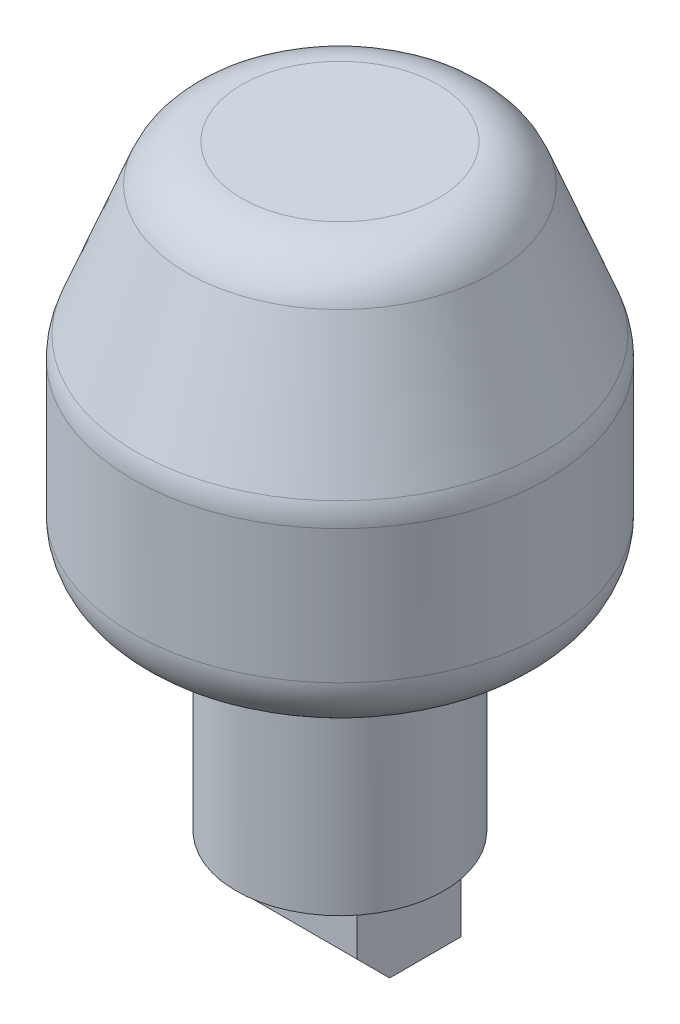
ISO-10303-21;
HEADER;
FILE_DESCRIPTION(('STEP AP214'),'2;1');
FILE_NAME('part.step','',(''),(''),'','','');
FILE_SCHEMA(('AUTOMOTIVE_DESIGN { 1 0 10303 214 1 1 1 1 }'));
ENDSEC;
DATA;
#1=APPLICATION_CONTEXT('core data for automotive mechanical design processes');
#2=APPLICATION_PROTOCOL_DEFINITION('international standard','automotive_design',2000,#1);
#3=PRODUCT_CONTEXT('',#1,'mechanical');
#4=PRODUCT('Part','Part','',(#3));
#5=PRODUCT_RELATED_PRODUCT_CATEGORY('part','',(#4));
#6=PRODUCT_DEFINITION_FORMATION('','',#4);
#7=PRODUCT_DEFINITION_CONTEXT('part definition',#1,'design');
#8=PRODUCT_DEFINITION('design','',#6,#7);
#9=PRODUCT_DEFINITION_SHAPE('','',#8);
#10=(LENGTH_UNIT() NAMED_UNIT(*) SI_UNIT(.MILLI.,.METRE.));
#11=(NAMED_UNIT(*) PLANE_ANGLE_UNIT() SI_UNIT($,.RADIAN.));
#12=(NAMED_UNIT(*) SI_UNIT($,.STERADIAN.) SOLID_ANGLE_UNIT());
#13=UNCERTAINTY_MEASURE_WITH_UNIT(LENGTH_MEASURE(1.E-05),#10,'distance_accuracy_value','');
#14=(GEOMETRIC_REPRESENTATION_CONTEXT(3) GLOBAL_UNCERTAINTY_ASSIGNED_CONTEXT((#13)) GLOBAL_UNIT_ASSIGNED_CONTEXT((#10,
#11,#12)) REPRESENTATION_CONTEXT('',''));
#15=CARTESIAN_POINT('',(0.,0.,0.));
#16=DIRECTION('',(0.,0.,1.));
#17=DIRECTION('',(1.,0.,0.));
#18=AXIS2_PLACEMENT_3D('',#15,#16,#17);
#19=CARTESIAN_POINT('',(7.4549,-9.01718142394338,0.));
#20=DIRECTION('',(0.,-1.,0.));
#21=DIRECTION('',(0.,0.,-1.));
#22=AXIS2_PLACEMENT_3D('',#19,#20,#21);
#23=PLANE('',#22);
#24=DIRECTION('',(0.,0.,1.));
#25=VECTOR('',#24,1.);
#26=CARTESIAN_POINT('',(7.3279,-9.01718142394338,0.));
#27=LINE('',#26,#25);
#28=CARTESIAN_POINT('',(7.3279,-9.01718142394338,-5.49919071197169));
#29=VERTEX_POINT('',#28);
#30=CARTESIAN_POINT('',(7.3279,-9.01718142394338,1.9430092880283));
#31=VERTEX_POINT('',#30);
#32=EDGE_CURVE('E59',#29,#31,#27,.T.);
#33=ORIENTED_EDGE('',*,*,#32,.F.);
#34=DIRECTION('',(1.,0.,0.));
#35=VECTOR('',#34,1.);
#36=CARTESIAN_POINT('',(0.,-9.01718142394338,-5.49919071197169));
#37=LINE('',#36,#35);
#38=CARTESIAN_POINT('',(2.54762,-9.01718142394338,-5.49919071197169));
#39=VERTEX_POINT('',#38);
#40=EDGE_CURVE('E210',#39,#29,#37,.T.);
#41=ORIENTED_EDGE('',*,*,#40,.F.);
#42=DIRECTION('',(0.,0.,-1.));
#43=VECTOR('',#42,1.);
#44=CARTESIAN_POINT('',(2.54762,-9.01718142394338,0.));
#45=LINE('',#44,#43);
#46=CARTESIAN_POINT('',(2.54762,-9.01718142394338,1.94300928802831));
#47=VERTEX_POINT('',#46);
#48=EDGE_CURVE('E225',#47,#39,#45,.T.);
#49=ORIENTED_EDGE('',*,*,#48,.F.);
#50=DIRECTION('',(-1.,0.,0.));
#51=VECTOR('',#50,1.);
#52=CARTESIAN_POINT('',(0.,-9.01718142394338,1.9430092880283));
#53=LINE('',#52,#51);
#54=EDGE_CURVE('E221',#31,#47,#53,.T.);
#55=ORIENTED_EDGE('',*,*,#54,.F.);
#56=EDGE_LOOP('',(#33,#41,#49,#55));
#57=FACE_BOUND('',#56,.T.);
#58=DIRECTION('',(-1.,0.,0.));
#59=VECTOR('',#58,1.);
#60=CARTESIAN_POINT('',(0.,-9.01718142394338,1.9430092880283));
#61=LINE('',#60,#59);
#62=CARTESIAN_POINT('',(-2.54762,-9.01718142394338,1.9430092880283));
#63=VERTEX_POINT('',#62);
#64=CARTESIAN_POINT('',(-7.3279,-9.01718142394338,1.9430092880283));
#65=VERTEX_POINT('',#64);
#66=EDGE_CURVE('E285',#63,#65,#61,.T.);
#67=ORIENTED_EDGE('',*,*,#66,.F.);
#68=DIRECTION('',(0.,0.,-1.));
#69=VECTOR('',#68,1.);
#70=CARTESIAN_POINT('',(-2.54762,-9.01718142394338,0.));
#71=LINE('',#70,#69);
#72=CARTESIAN_POINT('',(-2.54762,-9.01718142394338,-5.49919071197169));
#73=VERTEX_POINT('',#72);
#74=EDGE_CURVE('E263',#63,#73,#71,.T.);
#75=ORIENTED_EDGE('',*,*,#74,.T.);
#76=DIRECTION('',(1.,0.,0.));
#77=VECTOR('',#76,1.);
#78=CARTESIAN_POINT('',(0.,-9.01718142394338,-5.49919071197169));
#79=LINE('',#78,#77);
#80=CARTESIAN_POINT('',(-7.3279,-9.01718142394338,-5.49919071197169));
#81=VERTEX_POINT('',#80);
#82=EDGE_CURVE('E273',#81,#73,#79,.T.);
#83=ORIENTED_EDGE('',*,*,#82,.F.);
#84=DIRECTION('',(0.,0.,-1.));
#85=VECTOR('',#84,1.);
#86=CARTESIAN_POINT('',(-7.3279,-9.01718142394338,0.));
#87=LINE('',#86,#85);
#88=EDGE_CURVE('E288',#65,#81,#87,.T.);
#89=ORIENTED_EDGE('',*,*,#88,.F.);
#90=EDGE_LOOP('',(#67,#75,#83,#89));
#91=FACE_BOUND('',#90,.T.);
#92=DIRECTION('',(0.,0.,1.));
#93=VECTOR('',#92,1.);
#94=CARTESIAN_POINT('',(-7.4549,-9.01718142394338,0.));
#95=LINE('',#94,#93);
#96=CARTESIAN_POINT('',(-7.4549,-9.01718142394338,-5.6261907119717));
#97=VERTEX_POINT('',#96);
#98=CARTESIAN_POINT('',(-7.4549,-9.01718142394338,2.0700092880283));
#99=VERTEX_POINT('',#98);
#100=EDGE_CURVE('E323',#97,#99,#95,.T.);
#101=ORIENTED_EDGE('',*,*,#100,.F.);
#102=DIRECTION('',(-1.,0.,0.));
#103=VECTOR('',#102,1.);
#104=CARTESIAN_POINT('',(7.4549,-9.01718142394338,-5.6261907119717));
#105=LINE('',#104,#103);
#106=CARTESIAN_POINT('',(7.4549,-9.01718142394338,-5.6261907119717));
#107=VERTEX_POINT('',#106);
#108=EDGE_CURVE('E329',#107,#97,#105,.T.);
#109=ORIENTED_EDGE('',*,*,#108,.F.);
#110=DIRECTION('',(0.,0.,1.));
#111=VECTOR('',#110,1.);
#112=CARTESIAN_POINT('',(7.4549,-9.01718142394338,0.));
#113=LINE('',#112,#111);
#114=CARTESIAN_POINT('',(7.4549,-9.01718142394338,2.0700092880283));
#115=VERTEX_POINT('',#114);
#116=EDGE_CURVE('E309',#107,#115,#113,.T.);
#117=ORIENTED_EDGE('',*,*,#116,.T.);
#118=DIRECTION('',(-1.,0.,0.));
#119=VECTOR('',#118,1.);
#120=CARTESIAN_POINT('',(7.4549,-9.01718142394338,2.0700092880283));
#121=LINE('',#120,#119);
#122=EDGE_CURVE('E331',#115,#99,#121,.T.);
#123=ORIENTED_EDGE('',*,*,#122,.T.);
#124=EDGE_LOOP('',(#101,#109,#117,#123));
#125=FACE_BOUND('',#124,.T.);
#126=DIRECTION('',(-1.,0.,0.));
#127=VECTOR('',#126,1.);
#128=CARTESIAN_POINT('',(0.,-9.01718142394338,1.9430092880283));
#129=LINE('',#128,#127);
#130=CARTESIAN_POINT('',(2.42062,-9.01718142394338,1.9430092880283));
#131=VERTEX_POINT('',#130);
#132=CARTESIAN_POINT('',(-2.42062,-9.01718142394338,1.94300928802831));
#133=VERTEX_POINT('',#132);
#134=EDGE_CURVE('E253',#131,#133,#129,.T.);
#135=ORIENTED_EDGE('',*,*,#134,.F.);
#136=DIRECTION('',(0.,0.,-1.));
#137=VECTOR('',#136,1.);
#138=CARTESIAN_POINT('',(2.42062,-9.01718142394338,0.));
#139=LINE('',#138,#137);
#140=CARTESIAN_POINT('',(2.42062,-9.01718142394338,-5.49919071197169));
#141=VERTEX_POINT('',#140);
#142=EDGE_CURVE('E232',#131,#141,#139,.T.);
#143=ORIENTED_EDGE('',*,*,#142,.T.);
#144=DIRECTION('',(1.,0.,0.));
#145=VECTOR('',#144,1.);
#146=CARTESIAN_POINT('',(0.,-9.01718142394338,-5.49919071197169));
#147=LINE('',#146,#145);
#148=CARTESIAN_POINT('',(-2.42062,-9.01718142394338,-5.49919071197169));
#149=VERTEX_POINT('',#148);
#150=EDGE_CURVE('E241',#149,#141,#147,.T.);
#151=ORIENTED_EDGE('',*,*,#150,.F.);
#152=DIRECTION('',(0.,0.,-1.));
#153=VECTOR('',#152,1.);
#154=CARTESIAN_POINT('',(-2.42062,-9.01718142394338,0.));
#155=LINE('',#154,#153);
#156=EDGE_CURVE('E256',#133,#149,#155,.T.);
#157=ORIENTED_EDGE('',*,*,#156,.F.);
#158=EDGE_LOOP('',(#135,#143,#151,#157));
#159=FACE_BOUND('',#158,.T.);
#160=ADVANCED_FACE('F36',(#57,#91,#125,#159),#23,.T.);
#161=CARTESIAN_POINT('',(0.,0.,0.));
#162=DIRECTION('',(0.,1.,0.));
#163=DIRECTION('',(-1.,0.,0.));
#164=AXIS2_PLACEMENT_3D('',#161,#162,#163);
#165=PLANE('',#164);
#166=DIRECTION('',(-1.,0.,0.));
#167=VECTOR('',#166,1.);
#168=CARTESIAN_POINT('',(7.4549,0.,5.62619071197169));
#169=LINE('',#168,#167);
#170=CARTESIAN_POINT('',(7.4549,0.,5.62619071197169));
#171=VERTEX_POINT('',#170);
#172=CARTESIAN_POINT('',(-7.4549,0.,5.62619071197169));
#173=VERTEX_POINT('',#172);
#174=EDGE_CURVE('E336',#171,#173,#169,.T.);
#175=ORIENTED_EDGE('',*,*,#174,.F.);
#176=DIRECTION('',(0.,0.,-1.));
#177=VECTOR('',#176,1.);
#178=CARTESIAN_POINT('',(7.4549,0.,0.));
#179=LINE('',#178,#177);
#180=CARTESIAN_POINT('',(7.4549,0.,-5.62619071197169));
#181=VERTEX_POINT('',#180);
#182=EDGE_CURVE('E302',#171,#181,#179,.T.);
#183=ORIENTED_EDGE('',*,*,#182,.T.);
#184=DIRECTION('',(-1.,0.,0.));
#185=VECTOR('',#184,1.);
#186=CARTESIAN_POINT('',(7.4549,0.,-5.62619071197169));
#187=LINE('',#186,#185);
#188=CARTESIAN_POINT('',(-7.4549,0.,-5.62619071197169));
#189=VERTEX_POINT('',#188);
#190=EDGE_CURVE('E315',#181,#189,#187,.T.);
#191=ORIENTED_EDGE('',*,*,#190,.T.);
#192=DIRECTION('',(0.,0.,-1.));
#193=VECTOR('',#192,1.);
#194=CARTESIAN_POINT('',(-7.4549,0.,0.));
#195=LINE('',#194,#193);
#196=EDGE_CURVE('E295',#173,#189,#195,.T.);
#197=ORIENTED_EDGE('',*,*,#196,.F.);
#198=EDGE_LOOP('',(#175,#183,#191,#197));
#199=FACE_BOUND('',#198,.T.);
#200=CARTESIAN_POINT('',(0.,0.,0.));
#201=DIRECTION('',(0.,1.,0.));
#202=DIRECTION('',(-1.,0.,0.));
#203=AXIS2_PLACEMENT_3D('',#200,#201,#202);
#204=CIRCLE('',#203,11.2395);
#205=CARTESIAN_POINT('',(-11.2395,0.,0.));
#206=VERTEX_POINT('',#205);
#207=EDGE_CURVE('E341',#206,#206,#204,.T.);
#208=ORIENTED_EDGE('',*,*,#207,.F.);
#209=EDGE_LOOP('',(#208));
#210=FACE_BOUND('',#209,.T.);
#211=ADVANCED_FACE('F377',(#199,#210),#165,.F.);
#212=CARTESIAN_POINT('',(0.,64.6193127521161,0.));
#213=DIRECTION('',(0.,1.,0.));
#214=DIRECTION('',(-1.,0.,0.));
#215=AXIS2_PLACEMENT_3D('',#212,#213,#214);
#216=CYLINDRICAL_SURFACE('',#215,11.2395);
#217=CARTESIAN_POINT('',(0.,21.2344,0.));
#218=DIRECTION('',(0.,-1.,0.));
#219=DIRECTION('',(0.,0.,-1.));
#220=AXIS2_PLACEMENT_3D('',#217,#218,#219);
#221=CIRCLE('',#220,11.2395);
#222=CARTESIAN_POINT('',(-1.778,21.2344,11.0979762231679));
#223=VERTEX_POINT('',#222);
#224=CARTESIAN_POINT('',(1.778,21.2344,11.0979762231679));
#225=VERTEX_POINT('',#224);
#226=EDGE_CURVE('E183',#223,#225,#221,.F.);
#227=ORIENTED_EDGE('',*,*,#226,.F.);
#228=DIRECTION('',(0.,1.,0.));
#229=VECTOR('',#228,1.);
#230=CARTESIAN_POINT('',(-1.778,64.6193127521161,11.0979762231679));
#231=LINE('',#230,#229);
#232=CARTESIAN_POINT('',(-1.778,23.4188,11.0979762231679));
#233=VERTEX_POINT('',#232);
#234=EDGE_CURVE('E188',#233,#223,#231,.F.);
#235=ORIENTED_EDGE('',*,*,#234,.F.);
#236=CARTESIAN_POINT('',(0.,23.4188,0.));
#237=DIRECTION('',(0.,1.,0.));
#238=DIRECTION('',(-1.,0.,0.));
#239=AXIS2_PLACEMENT_3D('',#236,#237,#238);
#240=CIRCLE('',#239,11.2395);
#241=CARTESIAN_POINT('',(1.778,23.4188,11.0979762231679));
#242=VERTEX_POINT('',#241);
#243=EDGE_CURVE('E339',#242,#233,#240,.T.);
#244=ORIENTED_EDGE('',*,*,#243,.F.);
#245=DIRECTION('',(0.,1.,0.));
#246=VECTOR('',#245,1.);
#247=CARTESIAN_POINT('',(1.778,64.6193127521161,11.0979762231679));
#248=LINE('',#247,#246);
#249=EDGE_CURVE('E51',#225,#242,#248,.T.);
#250=ORIENTED_EDGE('',*,*,#249,.F.);
#251=EDGE_LOOP('',(#227,#235,#244,#250));
#252=FACE_BOUND('',#251,.T.);
#253=ORIENTED_EDGE('',*,*,#207,.T.);
#254=EDGE_LOOP('',(#253));
#255=FACE_BOUND('',#254,.T.);
#256=ADVANCED_FACE('F198',(#252,#255),#216,.T.);
#257=CARTESIAN_POINT('',(11.2395,23.4188,0.));
#258=DIRECTION('',(0.,1.,0.));
#259=DIRECTION('',(-1.,0.,0.));
#260=AXIS2_PLACEMENT_3D('',#257,#258,#259);
#261=PLANE('',#260);
#262=CARTESIAN_POINT('',(0.,23.4188,0.));
#263=DIRECTION('',(0.,1.,0.));
#264=DIRECTION('',(-1.,0.,0.));
#265=AXIS2_PLACEMENT_3D('',#262,#263,#264);
#266=CIRCLE('',#265,16.123370687632);
#267=CARTESIAN_POINT('',(-16.123370687632,23.4188,0.));
#268=VERTEX_POINT('',#267);
#269=EDGE_CURVE('E350',#268,#268,#266,.F.);
#270=ORIENTED_EDGE('',*,*,#269,.T.);
#271=EDGE_LOOP('',(#270));
#272=FACE_BOUND('',#271,.T.);
#273=ORIENTED_EDGE('',*,*,#243,.T.);
#274=DIRECTION('',(0.,0.,1.));
#275=VECTOR('',#274,1.);
#276=CARTESIAN_POINT('',(-1.778,23.4188,-22.474370687632));
#277=LINE('',#276,#275);
#278=CARTESIAN_POINT('',(-1.778,23.4188,14.29512));
#279=VERTEX_POINT('',#278);
#280=EDGE_CURVE('E193',#233,#279,#277,.T.);
#281=ORIENTED_EDGE('',*,*,#280,.T.);
#282=DIRECTION('',(-1.,0.,0.));
#283=VECTOR('',#282,1.);
#284=CARTESIAN_POINT('',(-1.778,23.4188,14.29512));
#285=LINE('',#284,#283);
#286=CARTESIAN_POINT('',(1.778,23.4188,14.29512));
#287=VERTEX_POINT('',#286);
#288=EDGE_CURVE('E771',#287,#279,#285,.T.);
#289=ORIENTED_EDGE('',*,*,#288,.F.);
#290=DIRECTION('',(0.,0.,1.));
#291=VECTOR('',#290,1.);
#292=CARTESIAN_POINT('',(1.778,23.4188,-22.474370687632));
#293=LINE('',#292,#291);
#294=EDGE_CURVE('E222',#242,#287,#293,.T.);
#295=ORIENTED_EDGE('',*,*,#294,.F.);
#296=EDGE_LOOP('',(#273,#281,#289,#295));
#297=FACE_BOUND('',#296,.T.);
#298=ADVANCED_FACE('F405',(#272,#297),#261,.F.);
#299=CARTESIAN_POINT('',(0.,64.6193127521161,0.));
#300=DIRECTION('',(0.,1.,0.));
#301=DIRECTION('',(-1.,0.,0.));
#302=AXIS2_PLACEMENT_3D('',#299,#300,#301);
#303=CYLINDRICAL_SURFACE('',#302,22.473370687632);
#304=CARTESIAN_POINT('',(0.,29.7688,0.));
#305=DIRECTION('',(0.,1.,0.));
#306=DIRECTION('',(-1.,0.,0.));
#307=AXIS2_PLACEMENT_3D('',#304,#305,#306);
#308=CIRCLE('',#307,22.473370687632);
#309=CARTESIAN_POINT('',(-22.473370687632,29.7688,0.));
#310=VERTEX_POINT('',#309);
#311=EDGE_CURVE('E347',#310,#310,#308,.T.);
#312=ORIENTED_EDGE('',*,*,#311,.T.);
#313=EDGE_LOOP('',(#312));
#314=FACE_BOUND('',#313,.T.);
#315=CARTESIAN_POINT('',(0.,44.2210933640308,0.));
#316=DIRECTION('',(0.,-1.,0.));
#317=DIRECTION('',(1.,0.,0.));
#318=AXIS2_PLACEMENT_3D('',#315,#316,#317);
#319=CIRCLE('',#318,22.473370687632);
#320=CARTESIAN_POINT('',(22.473370687632,44.2210933640308,0.));
#321=VERTEX_POINT('',#320);
#322=EDGE_CURVE('E344',#321,#321,#319,.T.);
#323=ORIENTED_EDGE('',*,*,#322,.T.);
#324=EDGE_LOOP('',(#323));
#325=FACE_BOUND('',#324,.T.);
#326=ADVANCED_FACE('F402',(#314,#325),#303,.T.);
#327=CARTESIAN_POINT('',(0.,45.4152,0.));
#328=DIRECTION('',(0.,-1.,0.));
#329=DIRECTION('',(1.,0.,0.));
#330=AXIS2_PLACEMENT_3D('',#327,#328,#329);
#331=CONICAL_SURFACE('',#330,22.473370687632,0.371755130674789);
#332=CARTESIAN_POINT('',(0.,46.5277386775342,0.));
#333=DIRECTION('',(0.,1.,0.));
#334=DIRECTION('',(-1.,0.,0.));
#335=AXIS2_PLACEMENT_3D('',#332,#333,#334);
#336=CIRCLE('',#335,22.0396099828003);
#337=CARTESIAN_POINT('',(-22.0396099828003,46.5277386775342,0.));
#338=VERTEX_POINT('',#337);
#339=EDGE_CURVE('E44',#338,#338,#336,.T.);
#340=ORIENTED_EDGE('',*,*,#339,.T.);
#341=EDGE_LOOP('',(#340));
#342=FACE_BOUND('',#341,.T.);
#343=CARTESIAN_POINT('',(0.,60.5759580656195,0.));
#344=DIRECTION('',(0.,1.,0.));
#345=DIRECTION('',(-1.,0.,0.));
#346=AXIS2_PLACEMENT_3D('',#343,#344,#345);
#347=CIRCLE('',#346,16.5624381177172);
#348=CARTESIAN_POINT('',(-16.5624381177172,60.5759580656195,0.));
#349=VERTEX_POINT('',#348);
#350=EDGE_CURVE('E353',#349,#349,#347,.F.);
#351=ORIENTED_EDGE('',*,*,#350,.T.);
#352=EDGE_LOOP('',(#351));
#353=FACE_BOUND('',#352,.T.);
#354=ADVANCED_FACE('F358',(#342,#353),#331,.T.);
#355=CARTESIAN_POINT('',(14.986,64.6193127521161,0.));
#356=DIRECTION('',(0.,-1.,0.));
#357=DIRECTION('',(1.,0.,0.));
#358=AXIS2_PLACEMENT_3D('',#355,#356,#357);
#359=PLANE('',#358);
#360=CARTESIAN_POINT('',(0.,64.6193127521161,0.));
#361=DIRECTION('',(0.,-1.,0.));
#362=DIRECTION('',(1.,0.,0.));
#363=AXIS2_PLACEMENT_3D('',#360,#361,#362);
#364=CIRCLE('',#363,10.6461988225489);
#365=CARTESIAN_POINT('',(10.6461988225489,64.6193127521161,0.));
#366=VERTEX_POINT('',#365);
#367=EDGE_CURVE('E11',#366,#366,#364,.F.);
#368=ORIENTED_EDGE('',*,*,#367,.T.);
#369=EDGE_LOOP('',(#368));
#370=FACE_BOUND('',#369,.T.);
#371=ADVANCED_FACE('F372',(#370),#359,.F.);
#372=CARTESIAN_POINT('',(0.,29.7688,0.));
#373=DIRECTION('',(0.,1.,0.));
#374=DIRECTION('',(-1.,0.,0.));
#375=AXIS2_PLACEMENT_3D('',#372,#373,#374);
#376=TOROIDAL_SURFACE('',#375,16.123370687632,6.35);
#377=ORIENTED_EDGE('',*,*,#269,.F.);
#378=EDGE_LOOP('',(#377));
#379=FACE_BOUND('',#378,.T.);
#380=ORIENTED_EDGE('',*,*,#311,.F.);
#381=EDGE_LOOP('',(#380));
#382=FACE_BOUND('',#381,.T.);
#383=ADVANCED_FACE('F363',(#379,#382),#376,.T.);
#384=CARTESIAN_POINT('',(0.,44.2210933640308,0.));
#385=DIRECTION('',(0.,-1.,0.));
#386=DIRECTION('',(1.,0.,0.));
#387=AXIS2_PLACEMENT_3D('',#384,#385,#386);
#388=TOROIDAL_SURFACE('',#387,16.123370687632,6.35);
#389=ORIENTED_EDGE('',*,*,#322,.F.);
#390=EDGE_LOOP('',(#389));
#391=FACE_BOUND('',#390,.T.);
#392=ORIENTED_EDGE('',*,*,#339,.F.);
#393=EDGE_LOOP('',(#392));
#394=FACE_BOUND('',#393,.T.);
#395=ADVANCED_FACE('F361',(#391,#394),#388,.T.);
#396=CARTESIAN_POINT('',(0.,58.2693127521161,0.));
#397=DIRECTION('',(0.,-1.,0.));
#398=DIRECTION('',(1.,0.,0.));
#399=AXIS2_PLACEMENT_3D('',#396,#397,#398);
#400=TOROIDAL_SURFACE('',#399,10.6461988225489,6.35);
#401=ORIENTED_EDGE('',*,*,#350,.F.);
#402=EDGE_LOOP('',(#401));
#403=FACE_BOUND('',#402,.T.);
#404=ORIENTED_EDGE('',*,*,#367,.F.);
#405=EDGE_LOOP('',(#404));
#406=FACE_BOUND('',#405,.T.);
#407=ADVANCED_FACE('F38',(#403,#406),#400,.T.);
#408=CARTESIAN_POINT('',(7.4549,0.,5.62619071197169));
#409=DIRECTION('',(0.,0.,-1.));
#410=DIRECTION('',(0.,1.,0.));
#411=AXIS2_PLACEMENT_3D('',#408,#409,#410);
#412=PLANE('',#411);
#413=DIRECTION('',(0.,-1.,0.));
#414=VECTOR('',#413,1.);
#415=CARTESIAN_POINT('',(-7.4549,0.,5.62619071197169));
#416=LINE('',#415,#414);
#417=CARTESIAN_POINT('',(-7.4549,-5.461,5.62619071197169));
#418=VERTEX_POINT('',#417);
#419=EDGE_CURVE('E318',#173,#418,#416,.T.);
#420=ORIENTED_EDGE('',*,*,#419,.T.);
#421=DIRECTION('',(-1.,0.,0.));
#422=VECTOR('',#421,1.);
#423=CARTESIAN_POINT('',(7.4549,-5.461,5.62619071197169));
#424=LINE('',#423,#422);
#425=CARTESIAN_POINT('',(7.4549,-5.461,5.62619071197169));
#426=VERTEX_POINT('',#425);
#427=EDGE_CURVE('E333',#426,#418,#424,.T.);
#428=ORIENTED_EDGE('',*,*,#427,.F.);
#429=DIRECTION('',(0.,-1.,0.));
#430=VECTOR('',#429,1.);
#431=CARTESIAN_POINT('',(7.4549,0.,5.62619071197169));
#432=LINE('',#431,#430);
#433=EDGE_CURVE('E304',#171,#426,#432,.T.);
#434=ORIENTED_EDGE('',*,*,#433,.F.);
#435=ORIENTED_EDGE('',*,*,#174,.T.);
#436=EDGE_LOOP('',(#420,#428,#434,#435));
#437=FACE_BOUND('',#436,.T.);
#438=ADVANCED_FACE('F369',(#437),#412,.F.);
#439=CARTESIAN_POINT('',(7.4549,-5.54359535598586,5.54359535598584));
#440=DIRECTION('',(0.,0.707106781186549,-0.707106781186546));
#441=DIRECTION('',(0.,0.707106781186546,0.707106781186549));
#442=AXIS2_PLACEMENT_3D('',#439,#440,#441);
#443=PLANE('',#442);
#444=DIRECTION('',(0.,-0.707106781186546,-0.707106781186549));
#445=VECTOR('',#444,1.);
#446=CARTESIAN_POINT('',(-7.4549,-5.54359535598586,5.54359535598584));
#447=LINE('',#446,#445);
#448=EDGE_CURVE('E320',#418,#99,#447,.T.);
#449=ORIENTED_EDGE('',*,*,#448,.T.);
#450=ORIENTED_EDGE('',*,*,#122,.F.);
#451=DIRECTION('',(0.,-0.707106781186546,-0.707106781186549));
#452=VECTOR('',#451,1.);
#453=CARTESIAN_POINT('',(7.4549,-5.54359535598586,5.54359535598584));
#454=LINE('',#453,#452);
#455=EDGE_CURVE('E307',#426,#115,#454,.T.);
#456=ORIENTED_EDGE('',*,*,#455,.F.);
#457=ORIENTED_EDGE('',*,*,#427,.T.);
#458=EDGE_LOOP('',(#449,#450,#456,#457));
#459=FACE_BOUND('',#458,.T.);
#460=ADVANCED_FACE('F392',(#459),#443,.F.);
#461=CARTESIAN_POINT('',(7.4549,0.,-5.62619071197169));
#462=DIRECTION('',(0.,0.,-1.));
#463=DIRECTION('',(0.,1.,0.));
#464=AXIS2_PLACEMENT_3D('',#461,#462,#463);
#465=PLANE('',#464);
#466=DIRECTION('',(0.,-1.,0.));
#467=VECTOR('',#466,1.);
#468=CARTESIAN_POINT('',(-7.4549,0.,-5.62619071197169));
#469=LINE('',#468,#467);
#470=EDGE_CURVE('E305',#189,#97,#469,.T.);
#471=ORIENTED_EDGE('',*,*,#470,.F.);
#472=ORIENTED_EDGE('',*,*,#190,.F.);
#473=DIRECTION('',(0.,-1.,0.));
#474=VECTOR('',#473,1.);
#475=CARTESIAN_POINT('',(7.4549,0.,-5.62619071197169));
#476=LINE('',#475,#474);
#477=EDGE_CURVE('E312',#181,#107,#476,.T.);
#478=ORIENTED_EDGE('',*,*,#477,.T.);
#479=ORIENTED_EDGE('',*,*,#108,.T.);
#480=EDGE_LOOP('',(#471,#472,#478,#479));
#481=FACE_BOUND('',#480,.T.);
#482=ADVANCED_FACE('F390',(#481),#465,.T.);
#483=CARTESIAN_POINT('',(7.4549,0.,0.));
#484=DIRECTION('',(1.,0.,0.));
#485=DIRECTION('',(0.,0.,-1.));
#486=AXIS2_PLACEMENT_3D('',#483,#484,#485);
#487=PLANE('',#486);
#488=ORIENTED_EDGE('',*,*,#182,.F.);
#489=ORIENTED_EDGE('',*,*,#433,.T.);
#490=ORIENTED_EDGE('',*,*,#455,.T.);
#491=ORIENTED_EDGE('',*,*,#116,.F.);
#492=ORIENTED_EDGE('',*,*,#477,.F.);
#493=EDGE_LOOP('',(#488,#489,#490,#491,#492));
#494=FACE_BOUND('',#493,.T.);
#495=ADVANCED_FACE('F521',(#494),#487,.T.);
#496=CARTESIAN_POINT('',(-7.4549,0.,0.));
#497=DIRECTION('',(1.,0.,0.));
#498=DIRECTION('',(0.,0.,-1.));
#499=AXIS2_PLACEMENT_3D('',#496,#497,#498);
#500=PLANE('',#499);
#501=ORIENTED_EDGE('',*,*,#196,.T.);
#502=ORIENTED_EDGE('',*,*,#470,.T.);
#503=ORIENTED_EDGE('',*,*,#100,.T.);
#504=ORIENTED_EDGE('',*,*,#448,.F.);
#505=ORIENTED_EDGE('',*,*,#419,.F.);
#506=EDGE_LOOP('',(#501,#502,#503,#504,#505));
#507=FACE_BOUND('',#506,.T.);
#508=ADVANCED_FACE('F519',(#507),#500,.F.);
#509=CARTESIAN_POINT('',(-2.54762,-6.47718142394338,0.));
#510=DIRECTION('',(-1.,0.,0.));
#511=DIRECTION('',(0.,0.,1.));
#512=AXIS2_PLACEMENT_3D('',#509,#510,#511);
#513=PLANE('',#512);
#514=ORIENTED_EDGE('',*,*,#74,.F.);
#515=DIRECTION('',(0.,-1.,0.));
#516=VECTOR('',#515,1.);
#517=CARTESIAN_POINT('',(-2.54762,-6.47718142394338,1.94300928802831));
#518=LINE('',#517,#516);
#519=CARTESIAN_POINT('',(-2.54762,-6.47718142394338,1.94300928802831));
#520=VERTEX_POINT('',#519);
#521=EDGE_CURVE('E282',#520,#63,#518,.T.);
#522=ORIENTED_EDGE('',*,*,#521,.F.);
#523=DIRECTION('',(0.,0.,-1.));
#524=VECTOR('',#523,1.);
#525=CARTESIAN_POINT('',(-2.54762,-6.47718142394338,0.));
#526=LINE('',#525,#524);
#527=CARTESIAN_POINT('',(-2.54762,-6.47718142394338,-5.49919071197169));
#528=VERTEX_POINT('',#527);
#529=EDGE_CURVE('E270',#520,#528,#526,.T.);
#530=ORIENTED_EDGE('',*,*,#529,.T.);
#531=DIRECTION('',(0.,-1.,0.));
#532=VECTOR('',#531,1.);
#533=CARTESIAN_POINT('',(-2.54762,-6.47718142394338,-5.49919071197169));
#534=LINE('',#533,#532);
#535=EDGE_CURVE('E293',#528,#73,#534,.T.);
#536=ORIENTED_EDGE('',*,*,#535,.T.);
#537=EDGE_LOOP('',(#514,#522,#530,#536));
#538=FACE_BOUND('',#537,.T.);
#539=ADVANCED_FACE('F509',(#538),#513,.T.);
#540=CARTESIAN_POINT('',(0.,-6.47718142394338,-5.49919071197169));
#541=DIRECTION('',(0.,0.,-1.));
#542=DIRECTION('',(0.,1.,0.));
#543=AXIS2_PLACEMENT_3D('',#540,#541,#542);
#544=PLANE('',#543);
#545=ORIENTED_EDGE('',*,*,#82,.T.);
#546=ORIENTED_EDGE('',*,*,#535,.F.);
#547=DIRECTION('',(1.,0.,0.));
#548=VECTOR('',#547,1.);
#549=CARTESIAN_POINT('',(0.,-6.47718142394338,-5.49919071197169));
#550=LINE('',#549,#548);
#551=CARTESIAN_POINT('',(-7.3279,-6.47718142394338,-5.49919071197169));
#552=VERTEX_POINT('',#551);
#553=EDGE_CURVE('E279',#552,#528,#550,.T.);
#554=ORIENTED_EDGE('',*,*,#553,.F.);
#555=DIRECTION('',(0.,-1.,0.));
#556=VECTOR('',#555,1.);
#557=CARTESIAN_POINT('',(-7.3279,-6.47718142394338,-5.49919071197169));
#558=LINE('',#557,#556);
#559=EDGE_CURVE('E296',#552,#81,#558,.T.);
#560=ORIENTED_EDGE('',*,*,#559,.T.);
#561=EDGE_LOOP('',(#545,#546,#554,#560));
#562=FACE_BOUND('',#561,.T.);
#563=ADVANCED_FACE('F505',(#562),#544,.F.);
#564=CARTESIAN_POINT('',(-7.3279,-6.47718142394338,0.));
#565=DIRECTION('',(-1.,0.,0.));
#566=DIRECTION('',(0.,0.,1.));
#567=AXIS2_PLACEMENT_3D('',#564,#565,#566);
#568=PLANE('',#567);
#569=ORIENTED_EDGE('',*,*,#88,.T.);
#570=ORIENTED_EDGE('',*,*,#559,.F.);
#571=DIRECTION('',(0.,0.,-1.));
#572=VECTOR('',#571,1.);
#573=CARTESIAN_POINT('',(-7.3279,-6.47718142394338,0.));
#574=LINE('',#573,#572);
#575=CARTESIAN_POINT('',(-7.3279,-6.47718142394338,1.94300928802831));
#576=VERTEX_POINT('',#575);
#577=EDGE_CURVE('E276',#576,#552,#574,.T.);
#578=ORIENTED_EDGE('',*,*,#577,.F.);
#579=DIRECTION('',(0.,-1.,0.));
#580=VECTOR('',#579,1.);
#581=CARTESIAN_POINT('',(-7.3279,-6.47718142394338,1.94300928802831));
#582=LINE('',#581,#580);
#583=EDGE_CURVE('E298',#576,#65,#582,.T.);
#584=ORIENTED_EDGE('',*,*,#583,.T.);
#585=EDGE_LOOP('',(#569,#570,#578,#584));
#586=FACE_BOUND('',#585,.T.);
#587=ADVANCED_FACE('F508',(#586),#568,.F.);
#588=CARTESIAN_POINT('',(0.,-6.47718142394338,1.94300928802831));
#589=DIRECTION('',(0.,0.,1.));
#590=DIRECTION('',(0.,-1.,0.));
#591=AXIS2_PLACEMENT_3D('',#588,#589,#590);
#592=PLANE('',#591);
#593=ORIENTED_EDGE('',*,*,#66,.T.);
#594=ORIENTED_EDGE('',*,*,#583,.F.);
#595=DIRECTION('',(-1.,0.,0.));
#596=VECTOR('',#595,1.);
#597=CARTESIAN_POINT('',(0.,-6.47718142394338,1.94300928802831));
#598=LINE('',#597,#596);
#599=EDGE_CURVE('E272',#520,#576,#598,.T.);
#600=ORIENTED_EDGE('',*,*,#599,.F.);
#601=ORIENTED_EDGE('',*,*,#521,.T.);
#602=EDGE_LOOP('',(#593,#594,#600,#601));
#603=FACE_BOUND('',#602,.T.);
#604=ADVANCED_FACE('F503',(#603),#592,.F.);
#605=CARTESIAN_POINT('',(0.,-6.47718142394338,0.));
#606=DIRECTION('',(0.,-1.,0.));
#607=DIRECTION('',(0.,0.,-1.));
#608=AXIS2_PLACEMENT_3D('',#605,#606,#607);
#609=PLANE('',#608);
#610=ORIENTED_EDGE('',*,*,#529,.F.);
#611=ORIENTED_EDGE('',*,*,#599,.T.);
#612=ORIENTED_EDGE('',*,*,#577,.T.);
#613=ORIENTED_EDGE('',*,*,#553,.T.);
#614=EDGE_LOOP('',(#610,#611,#612,#613));
#615=FACE_BOUND('',#614,.T.);
#616=ADVANCED_FACE('F499',(#615),#609,.T.);
#617=CARTESIAN_POINT('',(2.42062,-6.47718142394338,0.));
#618=DIRECTION('',(-1.,0.,0.));
#619=DIRECTION('',(0.,0.,1.));
#620=AXIS2_PLACEMENT_3D('',#617,#618,#619);
#621=PLANE('',#620);
#622=ORIENTED_EDGE('',*,*,#142,.F.);
#623=DIRECTION('',(0.,-1.,0.));
#624=VECTOR('',#623,1.);
#625=CARTESIAN_POINT('',(2.42062,-6.47718142394338,1.94300928802831));
#626=LINE('',#625,#624);
#627=CARTESIAN_POINT('',(2.42062,-6.47718142394338,1.94300928802831));
#628=VERTEX_POINT('',#627);
#629=EDGE_CURVE('E250',#628,#131,#626,.T.);
#630=ORIENTED_EDGE('',*,*,#629,.F.);
#631=DIRECTION('',(0.,0.,-1.));
#632=VECTOR('',#631,1.);
#633=CARTESIAN_POINT('',(2.42062,-6.47718142394338,0.));
#634=LINE('',#633,#632);
#635=CARTESIAN_POINT('',(2.42062,-6.47718142394338,-5.49919071197169));
#636=VERTEX_POINT('',#635);
#637=EDGE_CURVE('E238',#628,#636,#634,.T.);
#638=ORIENTED_EDGE('',*,*,#637,.T.);
#639=DIRECTION('',(0.,-1.,0.));
#640=VECTOR('',#639,1.);
#641=CARTESIAN_POINT('',(2.42062,-6.47718142394338,-5.49919071197169));
#642=LINE('',#641,#640);
#643=EDGE_CURVE('E261',#636,#141,#642,.T.);
#644=ORIENTED_EDGE('',*,*,#643,.T.);
#645=EDGE_LOOP('',(#622,#630,#638,#644));
#646=FACE_BOUND('',#645,.T.);
#647=ADVANCED_FACE('F489',(#646),#621,.T.);
#648=CARTESIAN_POINT('',(0.,-6.47718142394338,-5.49919071197169));
#649=DIRECTION('',(0.,0.,-1.));
#650=DIRECTION('',(0.,1.,0.));
#651=AXIS2_PLACEMENT_3D('',#648,#649,#650);
#652=PLANE('',#651);
#653=ORIENTED_EDGE('',*,*,#150,.T.);
#654=ORIENTED_EDGE('',*,*,#643,.F.);
#655=DIRECTION('',(1.,0.,0.));
#656=VECTOR('',#655,1.);
#657=CARTESIAN_POINT('',(0.,-6.47718142394338,-5.49919071197169));
#658=LINE('',#657,#656);
#659=CARTESIAN_POINT('',(-2.42062,-6.47718142394338,-5.49919071197169));
#660=VERTEX_POINT('',#659);
#661=EDGE_CURVE('E247',#660,#636,#658,.T.);
#662=ORIENTED_EDGE('',*,*,#661,.F.);
#663=DIRECTION('',(0.,-1.,0.));
#664=VECTOR('',#663,1.);
#665=CARTESIAN_POINT('',(-2.42062,-6.47718142394338,-5.49919071197169));
#666=LINE('',#665,#664);
#667=EDGE_CURVE('E264',#660,#149,#666,.T.);
#668=ORIENTED_EDGE('',*,*,#667,.T.);
#669=EDGE_LOOP('',(#653,#654,#662,#668));
#670=FACE_BOUND('',#669,.T.);
#671=ADVANCED_FACE('F485',(#670),#652,.F.);
#672=CARTESIAN_POINT('',(-2.42062,-6.47718142394338,0.));
#673=DIRECTION('',(-1.,0.,0.));
#674=DIRECTION('',(0.,0.,1.));
#675=AXIS2_PLACEMENT_3D('',#672,#673,#674);
#676=PLANE('',#675);
#677=ORIENTED_EDGE('',*,*,#156,.T.);
#678=ORIENTED_EDGE('',*,*,#667,.F.);
#679=DIRECTION('',(0.,0.,-1.));
#680=VECTOR('',#679,1.);
#681=CARTESIAN_POINT('',(-2.42062,-6.47718142394338,0.));
#682=LINE('',#681,#680);
#683=CARTESIAN_POINT('',(-2.42062,-6.47718142394338,1.94300928802831));
#684=VERTEX_POINT('',#683);
#685=EDGE_CURVE('E244',#684,#660,#682,.T.);
#686=ORIENTED_EDGE('',*,*,#685,.F.);
#687=DIRECTION('',(0.,-1.,0.));
#688=VECTOR('',#687,1.);
#689=CARTESIAN_POINT('',(-2.42062,-6.47718142394338,1.94300928802831));
#690=LINE('',#689,#688);
#691=EDGE_CURVE('E266',#684,#133,#690,.T.);
#692=ORIENTED_EDGE('',*,*,#691,.T.);
#693=EDGE_LOOP('',(#677,#678,#686,#692));
#694=FACE_BOUND('',#693,.T.);
#695=ADVANCED_FACE('F488',(#694),#676,.F.);
#696=CARTESIAN_POINT('',(0.,-6.47718142394338,1.94300928802831));
#697=DIRECTION('',(0.,0.,1.));
#698=DIRECTION('',(0.,-1.,0.));
#699=AXIS2_PLACEMENT_3D('',#696,#697,#698);
#700=PLANE('',#699);
#701=ORIENTED_EDGE('',*,*,#134,.T.);
#702=ORIENTED_EDGE('',*,*,#691,.F.);
#703=DIRECTION('',(-1.,0.,0.));
#704=VECTOR('',#703,1.);
#705=CARTESIAN_POINT('',(0.,-6.47718142394338,1.94300928802831));
#706=LINE('',#705,#704);
#707=EDGE_CURVE('E240',#628,#684,#706,.T.);
#708=ORIENTED_EDGE('',*,*,#707,.F.);
#709=ORIENTED_EDGE('',*,*,#629,.T.);
#710=EDGE_LOOP('',(#701,#702,#708,#709));
#711=FACE_BOUND('',#710,.T.);
#712=ADVANCED_FACE('F483',(#711),#700,.F.);
#713=CARTESIAN_POINT('',(0.,-6.47718142394338,0.));
#714=DIRECTION('',(0.,-1.,0.));
#715=DIRECTION('',(0.,0.,-1.));
#716=AXIS2_PLACEMENT_3D('',#713,#714,#715);
#717=PLANE('',#716);
#718=ORIENTED_EDGE('',*,*,#637,.F.);
#719=ORIENTED_EDGE('',*,*,#707,.T.);
#720=ORIENTED_EDGE('',*,*,#685,.T.);
#721=ORIENTED_EDGE('',*,*,#661,.T.);
#722=EDGE_LOOP('',(#718,#719,#720,#721));
#723=FACE_BOUND('',#722,.T.);
#724=ADVANCED_FACE('F480',(#723),#717,.T.);
#725=CARTESIAN_POINT('',(7.3279,-6.47718142394338,0.));
#726=DIRECTION('',(1.,0.,0.));
#727=DIRECTION('',(0.,0.,-1.));
#728=AXIS2_PLACEMENT_3D('',#725,#726,#727);
#729=PLANE('',#728);
#730=ORIENTED_EDGE('',*,*,#32,.T.);
#731=DIRECTION('',(0.,-1.,0.));
#732=VECTOR('',#731,1.);
#733=CARTESIAN_POINT('',(7.3279,-6.47718142394338,1.94300928802831));
#734=LINE('',#733,#732);
#735=CARTESIAN_POINT('',(7.3279,-6.47718142394338,1.94300928802831));
#736=VERTEX_POINT('',#735);
#737=EDGE_CURVE('E219',#736,#31,#734,.T.);
#738=ORIENTED_EDGE('',*,*,#737,.F.);
#739=DIRECTION('',(0.,0.,1.));
#740=VECTOR('',#739,1.);
#741=CARTESIAN_POINT('',(7.3279,-6.47718142394338,0.));
#742=LINE('',#741,#740);
#743=CARTESIAN_POINT('',(7.3279,-6.47718142394338,-5.49919071197169));
#744=VERTEX_POINT('',#743);
#745=EDGE_CURVE('E206',#744,#736,#742,.T.);
#746=ORIENTED_EDGE('',*,*,#745,.F.);
#747=DIRECTION('',(0.,-1.,0.));
#748=VECTOR('',#747,1.);
#749=CARTESIAN_POINT('',(7.3279,-6.47718142394338,-5.49919071197169));
#750=LINE('',#749,#748);
#751=EDGE_CURVE('E230',#744,#29,#750,.T.);
#752=ORIENTED_EDGE('',*,*,#751,.T.);
#753=EDGE_LOOP('',(#730,#738,#746,#752));
#754=FACE_BOUND('',#753,.T.);
#755=ADVANCED_FACE('F470',(#754),#729,.F.);
#756=CARTESIAN_POINT('',(0.,-6.47718142394338,-5.49919071197169));
#757=DIRECTION('',(0.,0.,-1.));
#758=DIRECTION('',(0.,1.,0.));
#759=AXIS2_PLACEMENT_3D('',#756,#757,#758);
#760=PLANE('',#759);
#761=ORIENTED_EDGE('',*,*,#40,.T.);
#762=ORIENTED_EDGE('',*,*,#751,.F.);
#763=DIRECTION('',(1.,0.,0.));
#764=VECTOR('',#763,1.);
#765=CARTESIAN_POINT('',(0.,-6.47718142394338,-5.49919071197169));
#766=LINE('',#765,#764);
#767=CARTESIAN_POINT('',(2.54762,-6.47718142394338,-5.49919071197169));
#768=VERTEX_POINT('',#767);
#769=EDGE_CURVE('E216',#768,#744,#766,.T.);
#770=ORIENTED_EDGE('',*,*,#769,.F.);
#771=DIRECTION('',(0.,-1.,0.));
#772=VECTOR('',#771,1.);
#773=CARTESIAN_POINT('',(2.54762,-6.47718142394338,-5.49919071197169));
#774=LINE('',#773,#772);
#775=EDGE_CURVE('E233',#768,#39,#774,.T.);
#776=ORIENTED_EDGE('',*,*,#775,.T.);
#777=EDGE_LOOP('',(#761,#762,#770,#776));
#778=FACE_BOUND('',#777,.T.);
#779=ADVANCED_FACE('F466',(#778),#760,.F.);
#780=CARTESIAN_POINT('',(2.54762,-6.47718142394338,0.));
#781=DIRECTION('',(-1.,0.,0.));
#782=DIRECTION('',(0.,0.,1.));
#783=AXIS2_PLACEMENT_3D('',#780,#781,#782);
#784=PLANE('',#783);
#785=ORIENTED_EDGE('',*,*,#48,.T.);
#786=ORIENTED_EDGE('',*,*,#775,.F.);
#787=DIRECTION('',(0.,0.,-1.));
#788=VECTOR('',#787,1.);
#789=CARTESIAN_POINT('',(2.54762,-6.47718142394338,0.));
#790=LINE('',#789,#788);
#791=CARTESIAN_POINT('',(2.54762,-6.47718142394338,1.94300928802831));
#792=VERTEX_POINT('',#791);
#793=EDGE_CURVE('E213',#792,#768,#790,.T.);
#794=ORIENTED_EDGE('',*,*,#793,.F.);
#795=DIRECTION('',(0.,-1.,0.));
#796=VECTOR('',#795,1.);
#797=CARTESIAN_POINT('',(2.54762,-6.47718142394338,1.94300928802831));
#798=LINE('',#797,#796);
#799=EDGE_CURVE('E235',#792,#47,#798,.T.);
#800=ORIENTED_EDGE('',*,*,#799,.T.);
#801=EDGE_LOOP('',(#785,#786,#794,#800));
#802=FACE_BOUND('',#801,.T.);
#803=ADVANCED_FACE('F469',(#802),#784,.F.);
#804=CARTESIAN_POINT('',(0.,-6.47718142394338,1.94300928802831));
#805=DIRECTION('',(0.,0.,1.));
#806=DIRECTION('',(0.,-1.,0.));
#807=AXIS2_PLACEMENT_3D('',#804,#805,#806);
#808=PLANE('',#807);
#809=ORIENTED_EDGE('',*,*,#54,.T.);
#810=ORIENTED_EDGE('',*,*,#799,.F.);
#811=DIRECTION('',(-1.,0.,0.));
#812=VECTOR('',#811,1.);
#813=CARTESIAN_POINT('',(0.,-6.47718142394338,1.94300928802831));
#814=LINE('',#813,#812);
#815=EDGE_CURVE('E209',#736,#792,#814,.T.);
#816=ORIENTED_EDGE('',*,*,#815,.F.);
#817=ORIENTED_EDGE('',*,*,#737,.T.);
#818=EDGE_LOOP('',(#809,#810,#816,#817));
#819=FACE_BOUND('',#818,.T.);
#820=ADVANCED_FACE('F464',(#819),#808,.F.);
#821=CARTESIAN_POINT('',(0.,-6.47718142394338,0.));
#822=DIRECTION('',(0.,-1.,0.));
#823=DIRECTION('',(0.,0.,-1.));
#824=AXIS2_PLACEMENT_3D('',#821,#822,#823);
#825=PLANE('',#824);
#826=ORIENTED_EDGE('',*,*,#745,.T.);
#827=ORIENTED_EDGE('',*,*,#815,.T.);
#828=ORIENTED_EDGE('',*,*,#793,.T.);
#829=ORIENTED_EDGE('',*,*,#769,.T.);
#830=EDGE_LOOP('',(#826,#827,#828,#829));
#831=FACE_BOUND('',#830,.T.);
#832=ADVANCED_FACE('F418',(#831),#825,.T.);
#833=CARTESIAN_POINT('',(0.,0.,14.29512));
#834=DIRECTION('',(0.,0.,-1.));
#835=DIRECTION('',(-1.,0.,0.));
#836=AXIS2_PLACEMENT_3D('',#833,#834,#835);
#837=PLANE('',#836);
#838=DIRECTION('',(0.,1.,0.));
#839=VECTOR('',#838,1.);
#840=CARTESIAN_POINT('',(1.778,21.2344,14.29512));
#841=LINE('',#840,#839);
#842=CARTESIAN_POINT('',(1.778,21.2344,14.29512));
#843=VERTEX_POINT('',#842);
#844=EDGE_CURVE('E768',#843,#287,#841,.T.);
#845=ORIENTED_EDGE('',*,*,#844,.T.);
#846=ORIENTED_EDGE('',*,*,#288,.T.);
#847=DIRECTION('',(0.,-1.,0.));
#848=VECTOR('',#847,1.);
#849=CARTESIAN_POINT('',(-1.778,21.2344,14.29512));
#850=LINE('',#849,#848);
#851=CARTESIAN_POINT('',(-1.778,21.2344,14.29512));
#852=VERTEX_POINT('',#851);
#853=EDGE_CURVE('E773',#279,#852,#850,.T.);
#854=ORIENTED_EDGE('',*,*,#853,.T.);
#855=DIRECTION('',(1.,0.,0.));
#856=VECTOR('',#855,1.);
#857=CARTESIAN_POINT('',(-1.778,21.2344,14.29512));
#858=LINE('',#857,#856);
#859=EDGE_CURVE('E185',#852,#843,#858,.T.);
#860=ORIENTED_EDGE('',*,*,#859,.T.);
#861=EDGE_LOOP('',(#845,#846,#854,#860));
#862=FACE_BOUND('',#861,.T.);
#863=ADVANCED_FACE('F427',(#862),#837,.F.);
#864=CARTESIAN_POINT('',(-1.778,21.2344,-22.474370687632));
#865=DIRECTION('',(-1.,0.,0.));
#866=DIRECTION('',(0.,0.,1.));
#867=AXIS2_PLACEMENT_3D('',#864,#865,#866);
#868=PLANE('',#867);
#869=ORIENTED_EDGE('',*,*,#280,.F.);
#870=ORIENTED_EDGE('',*,*,#234,.T.);
#871=DIRECTION('',(0.,0.,1.));
#872=VECTOR('',#871,1.);
#873=CARTESIAN_POINT('',(-1.778,21.2344,-22.474370687632));
#874=LINE('',#873,#872);
#875=EDGE_CURVE('E179',#223,#852,#874,.T.);
#876=ORIENTED_EDGE('',*,*,#875,.T.);
#877=ORIENTED_EDGE('',*,*,#853,.F.);
#878=EDGE_LOOP('',(#869,#870,#876,#877));
#879=FACE_BOUND('',#878,.T.);
#880=ADVANCED_FACE('F191',(#879),#868,.T.);
#881=CARTESIAN_POINT('',(-1.778,21.2344,-22.474370687632));
#882=DIRECTION('',(0.,-1.,0.));
#883=DIRECTION('',(0.,0.,-1.));
#884=AXIS2_PLACEMENT_3D('',#881,#882,#883);
#885=PLANE('',#884);
#886=ORIENTED_EDGE('',*,*,#875,.F.);
#887=ORIENTED_EDGE('',*,*,#226,.T.);
#888=DIRECTION('',(0.,0.,1.));
#889=VECTOR('',#888,1.);
#890=CARTESIAN_POINT('',(1.778,21.2344,-22.474370687632));
#891=LINE('',#890,#889);
#892=EDGE_CURVE('E200',#225,#843,#891,.T.);
#893=ORIENTED_EDGE('',*,*,#892,.T.);
#894=ORIENTED_EDGE('',*,*,#859,.F.);
#895=EDGE_LOOP('',(#886,#887,#893,#894));
#896=FACE_BOUND('',#895,.T.);
#897=ADVANCED_FACE('F181',(#896),#885,.T.);
#898=CARTESIAN_POINT('',(1.778,21.2344,-22.474370687632));
#899=DIRECTION('',(1.,0.,0.));
#900=DIRECTION('',(0.,0.,-1.));
#901=AXIS2_PLACEMENT_3D('',#898,#899,#900);
#902=PLANE('',#901);
#903=ORIENTED_EDGE('',*,*,#892,.F.);
#904=ORIENTED_EDGE('',*,*,#249,.T.);
#905=ORIENTED_EDGE('',*,*,#294,.T.);
#906=ORIENTED_EDGE('',*,*,#844,.F.);
#907=EDGE_LOOP('',(#903,#904,#905,#906));
#908=FACE_BOUND('',#907,.T.);
#909=ADVANCED_FACE('F449',(#908),#902,.T.);
#910=CLOSED_SHELL('',(#160,#211,#256,#298,#326,#354,#371,#383,#395,#407,#438,#460,#482,#495,
#508,#539,#563,#587,#604,#616,#647,#671,#695,#712,#724,#755,#779,#803,#820,#832,#863,#880,#897,#909));
#911=MANIFOLD_SOLID_BREP('B2',#910);
#912=ADVANCED_BREP_SHAPE_REPRESENTATION('',(#18,#911),#14);
#913=SHAPE_DEFINITION_REPRESENTATION(#9,#912);
ENDSEC;
END-ISO-10303-21;
